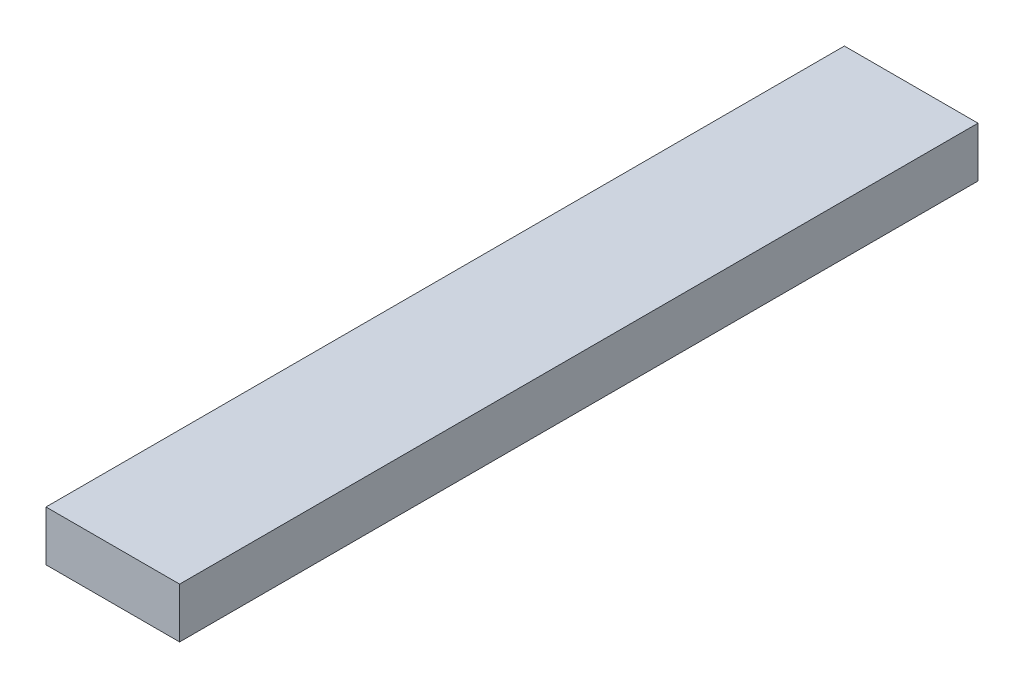
ISO-10303-21;
HEADER;
FILE_DESCRIPTION(('STEP AP214'),'2;1');
FILE_NAME('part.step','',(''),(''),'','','');
FILE_SCHEMA(('AUTOMOTIVE_DESIGN { 1 0 10303 214 1 1 1 1 }'));
ENDSEC;
DATA;
#1=APPLICATION_CONTEXT('core data for automotive mechanical design processes');
#2=APPLICATION_PROTOCOL_DEFINITION('international standard','automotive_design',2000,#1);
#3=PRODUCT_CONTEXT('',#1,'mechanical');
#4=PRODUCT('Part','Part','',(#3));
#5=PRODUCT_RELATED_PRODUCT_CATEGORY('part','',(#4));
#6=PRODUCT_DEFINITION_FORMATION('','',#4);
#7=PRODUCT_DEFINITION_CONTEXT('part definition',#1,'design');
#8=PRODUCT_DEFINITION('design','',#6,#7);
#9=PRODUCT_DEFINITION_SHAPE('','',#8);
#10=(LENGTH_UNIT() NAMED_UNIT(*) SI_UNIT(.MILLI.,.METRE.));
#11=(NAMED_UNIT(*) PLANE_ANGLE_UNIT() SI_UNIT($,.RADIAN.));
#12=(NAMED_UNIT(*) SI_UNIT($,.STERADIAN.) SOLID_ANGLE_UNIT());
#13=UNCERTAINTY_MEASURE_WITH_UNIT(LENGTH_MEASURE(1.E-05),#10,'distance_accuracy_value','');
#14=(GEOMETRIC_REPRESENTATION_CONTEXT(3) GLOBAL_UNCERTAINTY_ASSIGNED_CONTEXT((#13)) GLOBAL_UNIT_ASSIGNED_CONTEXT((#10,
#11,#12)) REPRESENTATION_CONTEXT('',''));
#15=CARTESIAN_POINT('',(0.,0.,0.));
#16=DIRECTION('',(0.,0.,1.));
#17=DIRECTION('',(1.,0.,0.));
#18=AXIS2_PLACEMENT_3D('',#15,#16,#17);
#19=CARTESIAN_POINT('',(0.,30.,0.));
#20=DIRECTION('',(1.,0.,0.));
#21=DIRECTION('',(0.,0.,-1.));
#22=AXIS2_PLACEMENT_3D('',#19,#20,#21);
#23=PLANE('',#22);
#24=DIRECTION('',(0.,0.,1.));
#25=VECTOR('',#24,1.);
#26=CARTESIAN_POINT('',(0.,0.,0.));
#27=LINE('',#26,#25);
#28=CARTESIAN_POINT('',(0.,0.,-478.));
#29=VERTEX_POINT('',#28);
#30=CARTESIAN_POINT('',(0.,0.,0.));
#31=VERTEX_POINT('',#30);
#32=EDGE_CURVE('E98',#29,#31,#27,.T.);
#33=ORIENTED_EDGE('',*,*,#32,.T.);
#34=DIRECTION('',(0.,-1.,0.));
#35=VECTOR('',#34,1.);
#36=CARTESIAN_POINT('',(0.,30.,0.));
#37=LINE('',#36,#35);
#38=CARTESIAN_POINT('',(0.,30.,0.));
#39=VERTEX_POINT('',#38);
#40=EDGE_CURVE('E11',#39,#31,#37,.T.);
#41=ORIENTED_EDGE('',*,*,#40,.F.);
#42=DIRECTION('',(0.,0.,1.));
#43=VECTOR('',#42,1.);
#44=CARTESIAN_POINT('',(0.,30.,0.));
#45=LINE('',#44,#43);
#46=CARTESIAN_POINT('',(0.,30.,-478.));
#47=VERTEX_POINT('',#46);
#48=EDGE_CURVE('E86',#47,#39,#45,.T.);
#49=ORIENTED_EDGE('',*,*,#48,.F.);
#50=DIRECTION('',(0.,-1.,0.));
#51=VECTOR('',#50,1.);
#52=CARTESIAN_POINT('',(0.,30.,-478.));
#53=LINE('',#52,#51);
#54=EDGE_CURVE('E94',#47,#29,#53,.T.);
#55=ORIENTED_EDGE('',*,*,#54,.T.);
#56=EDGE_LOOP('',(#33,#41,#49,#55));
#57=FACE_BOUND('',#56,.T.);
#58=ADVANCED_FACE('F35',(#57),#23,.F.);
#59=CARTESIAN_POINT('',(0.,30.,0.));
#60=DIRECTION('',(0.,0.,-1.));
#61=DIRECTION('',(-1.,0.,0.));
#62=AXIS2_PLACEMENT_3D('',#59,#60,#61);
#63=PLANE('',#62);
#64=DIRECTION('',(1.,0.,0.));
#65=VECTOR('',#64,1.);
#66=CARTESIAN_POINT('',(0.,0.,0.));
#67=LINE('',#66,#65);
#68=CARTESIAN_POINT('',(80.,0.,0.));
#69=VERTEX_POINT('',#68);
#70=EDGE_CURVE('E90',#31,#69,#67,.T.);
#71=ORIENTED_EDGE('',*,*,#70,.T.);
#72=DIRECTION('',(0.,-1.,0.));
#73=VECTOR('',#72,1.);
#74=CARTESIAN_POINT('',(80.,30.,0.));
#75=LINE('',#74,#73);
#76=CARTESIAN_POINT('',(80.,30.,0.));
#77=VERTEX_POINT('',#76);
#78=EDGE_CURVE('E43',#77,#69,#75,.T.);
#79=ORIENTED_EDGE('',*,*,#78,.F.);
#80=DIRECTION('',(1.,0.,0.));
#81=VECTOR('',#80,1.);
#82=CARTESIAN_POINT('',(0.,30.,0.));
#83=LINE('',#82,#81);
#84=EDGE_CURVE('E81',#39,#77,#83,.T.);
#85=ORIENTED_EDGE('',*,*,#84,.F.);
#86=ORIENTED_EDGE('',*,*,#40,.T.);
#87=EDGE_LOOP('',(#71,#79,#85,#86));
#88=FACE_BOUND('',#87,.T.);
#89=ADVANCED_FACE('F89',(#88),#63,.F.);
#90=CARTESIAN_POINT('',(80.,30.,0.));
#91=DIRECTION('',(-1.,0.,0.));
#92=DIRECTION('',(0.,0.,1.));
#93=AXIS2_PLACEMENT_3D('',#90,#91,#92);
#94=PLANE('',#93);
#95=DIRECTION('',(0.,0.,-1.));
#96=VECTOR('',#95,1.);
#97=CARTESIAN_POINT('',(80.,0.,0.));
#98=LINE('',#97,#96);
#99=CARTESIAN_POINT('',(80.,0.,-478.));
#100=VERTEX_POINT('',#99);
#101=EDGE_CURVE('E68',#69,#100,#98,.T.);
#102=ORIENTED_EDGE('',*,*,#101,.T.);
#103=DIRECTION('',(0.,-1.,0.));
#104=VECTOR('',#103,1.);
#105=CARTESIAN_POINT('',(80.,30.,-478.));
#106=LINE('',#105,#104);
#107=CARTESIAN_POINT('',(80.,30.,-478.));
#108=VERTEX_POINT('',#107);
#109=EDGE_CURVE('E91',#108,#100,#106,.T.);
#110=ORIENTED_EDGE('',*,*,#109,.F.);
#111=DIRECTION('',(0.,0.,-1.));
#112=VECTOR('',#111,1.);
#113=CARTESIAN_POINT('',(80.,30.,0.));
#114=LINE('',#113,#112);
#115=EDGE_CURVE('E84',#77,#108,#114,.T.);
#116=ORIENTED_EDGE('',*,*,#115,.F.);
#117=ORIENTED_EDGE('',*,*,#78,.T.);
#118=EDGE_LOOP('',(#102,#110,#116,#117));
#119=FACE_BOUND('',#118,.T.);
#120=ADVANCED_FACE('F92',(#119),#94,.F.);
#121=CARTESIAN_POINT('',(0.,30.,-478.));
#122=DIRECTION('',(0.,0.,1.));
#123=DIRECTION('',(1.,0.,0.));
#124=AXIS2_PLACEMENT_3D('',#121,#122,#123);
#125=PLANE('',#124);
#126=DIRECTION('',(-1.,0.,0.));
#127=VECTOR('',#126,1.);
#128=CARTESIAN_POINT('',(0.,0.,-478.));
#129=LINE('',#128,#127);
#130=EDGE_CURVE('E74',#100,#29,#129,.T.);
#131=ORIENTED_EDGE('',*,*,#130,.T.);
#132=ORIENTED_EDGE('',*,*,#54,.F.);
#133=DIRECTION('',(-1.,0.,0.));
#134=VECTOR('',#133,1.);
#135=CARTESIAN_POINT('',(0.,30.,-478.));
#136=LINE('',#135,#134);
#137=EDGE_CURVE('E51',#108,#47,#136,.T.);
#138=ORIENTED_EDGE('',*,*,#137,.F.);
#139=ORIENTED_EDGE('',*,*,#109,.T.);
#140=EDGE_LOOP('',(#131,#132,#138,#139));
#141=FACE_BOUND('',#140,.T.);
#142=ADVANCED_FACE('F105',(#141),#125,.F.);
#143=CARTESIAN_POINT('',(0.,30.,0.));
#144=DIRECTION('',(0.,-1.,0.));
#145=DIRECTION('',(0.,0.,-1.));
#146=AXIS2_PLACEMENT_3D('',#143,#144,#145);
#147=PLANE('',#146);
#148=ORIENTED_EDGE('',*,*,#48,.T.);
#149=ORIENTED_EDGE('',*,*,#84,.T.);
#150=ORIENTED_EDGE('',*,*,#115,.T.);
#151=ORIENTED_EDGE('',*,*,#137,.T.);
#152=EDGE_LOOP('',(#148,#149,#150,#151));
#153=FACE_BOUND('',#152,.T.);
#154=ADVANCED_FACE('F82',(#153),#147,.F.);
#155=CARTESIAN_POINT('',(0.,0.,0.));
#156=DIRECTION('',(0.,-1.,0.));
#157=DIRECTION('',(0.,0.,-1.));
#158=AXIS2_PLACEMENT_3D('',#155,#156,#157);
#159=PLANE('',#158);
#160=ORIENTED_EDGE('',*,*,#32,.F.);
#161=ORIENTED_EDGE('',*,*,#130,.F.);
#162=ORIENTED_EDGE('',*,*,#101,.F.);
#163=ORIENTED_EDGE('',*,*,#70,.F.);
#164=EDGE_LOOP('',(#160,#161,#162,#163));
#165=FACE_BOUND('',#164,.T.);
#166=ADVANCED_FACE('F108',(#165),#159,.T.);
#167=CLOSED_SHELL('',(#58,#89,#120,#142,#154,#166));
#168=MANIFOLD_SOLID_BREP('B2',#167);
#169=ADVANCED_BREP_SHAPE_REPRESENTATION('',(#18,#168),#14);
#170=SHAPE_DEFINITION_REPRESENTATION(#9,#169);
ENDSEC;
END-ISO-10303-21;
